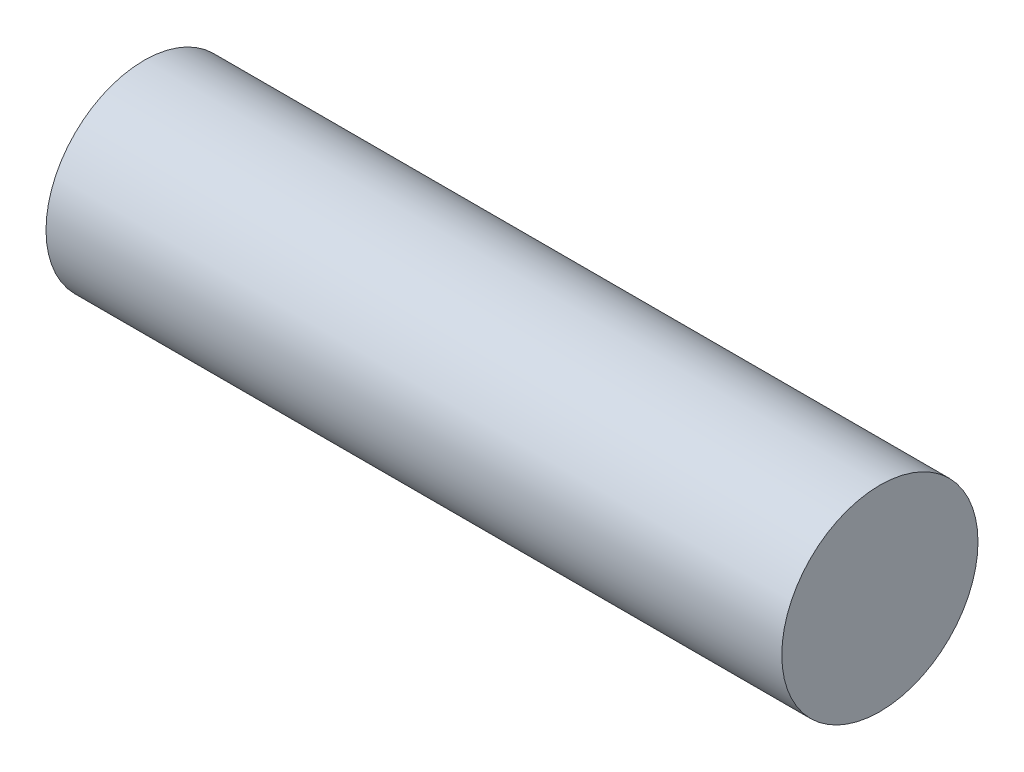
ISO-10303-21;
HEADER;
FILE_DESCRIPTION(('STEP AP214'),'2;1');
FILE_NAME('part.step','',(''),(''),'','','');
FILE_SCHEMA(('AUTOMOTIVE_DESIGN { 1 0 10303 214 1 1 1 1 }'));
ENDSEC;
DATA;
#1=APPLICATION_CONTEXT('core data for automotive mechanical design processes');
#2=APPLICATION_PROTOCOL_DEFINITION('international standard','automotive_design',2000,#1);
#3=PRODUCT_CONTEXT('',#1,'mechanical');
#4=PRODUCT('Part','Part','',(#3));
#5=PRODUCT_RELATED_PRODUCT_CATEGORY('part','',(#4));
#6=PRODUCT_DEFINITION_FORMATION('','',#4);
#7=PRODUCT_DEFINITION_CONTEXT('part definition',#1,'design');
#8=PRODUCT_DEFINITION('design','',#6,#7);
#9=PRODUCT_DEFINITION_SHAPE('','',#8);
#10=(LENGTH_UNIT() NAMED_UNIT(*) SI_UNIT(.MILLI.,.METRE.));
#11=(NAMED_UNIT(*) PLANE_ANGLE_UNIT() SI_UNIT($,.RADIAN.));
#12=(NAMED_UNIT(*) SI_UNIT($,.STERADIAN.) SOLID_ANGLE_UNIT());
#13=UNCERTAINTY_MEASURE_WITH_UNIT(LENGTH_MEASURE(1.E-05),#10,'distance_accuracy_value','');
#14=(GEOMETRIC_REPRESENTATION_CONTEXT(3) GLOBAL_UNCERTAINTY_ASSIGNED_CONTEXT((#13)) GLOBAL_UNIT_ASSIGNED_CONTEXT((#10,
#11,#12)) REPRESENTATION_CONTEXT('',''));
#15=CARTESIAN_POINT('',(0.,0.,0.));
#16=DIRECTION('',(0.,0.,1.));
#17=DIRECTION('',(1.,0.,0.));
#18=AXIS2_PLACEMENT_3D('',#15,#16,#17);
#19=CARTESIAN_POINT('',(300.,0.,0.));
#20=DIRECTION('',(-1.,0.,0.));
#21=DIRECTION('',(0.,0.,1.));
#22=AXIS2_PLACEMENT_3D('',#19,#20,#21);
#23=CYLINDRICAL_SURFACE('',#22,40.);
#24=CARTESIAN_POINT('',(300.,0.,0.));
#25=DIRECTION('',(1.,0.,0.));
#26=DIRECTION('',(0.,0.,-1.));
#27=AXIS2_PLACEMENT_3D('',#24,#25,#26);
#28=CIRCLE('',#27,40.);
#29=CARTESIAN_POINT('',(300.,0.,-40.));
#30=VERTEX_POINT('',#29);
#31=EDGE_CURVE('E10',#30,#30,#28,.T.);
#32=ORIENTED_EDGE('',*,*,#31,.F.);
#33=EDGE_LOOP('',(#32));
#34=FACE_BOUND('',#33,.T.);
#35=CARTESIAN_POINT('',(0.,0.,0.));
#36=DIRECTION('',(1.,0.,0.));
#37=DIRECTION('',(0.,0.,-1.));
#38=AXIS2_PLACEMENT_3D('',#35,#36,#37);
#39=CIRCLE('',#38,40.);
#40=CARTESIAN_POINT('',(0.,0.,-40.));
#41=VERTEX_POINT('',#40);
#42=EDGE_CURVE('E40',#41,#41,#39,.T.);
#43=ORIENTED_EDGE('',*,*,#42,.T.);
#44=EDGE_LOOP('',(#43));
#45=FACE_BOUND('',#44,.T.);
#46=ADVANCED_FACE('F37',(#34,#45),#23,.T.);
#47=CARTESIAN_POINT('',(300.,0.,0.));
#48=DIRECTION('',(1.,0.,0.));
#49=DIRECTION('',(0.,0.,-1.));
#50=AXIS2_PLACEMENT_3D('',#47,#48,#49);
#51=PLANE('',#50);
#52=ORIENTED_EDGE('',*,*,#31,.T.);
#53=EDGE_LOOP('',(#52));
#54=FACE_BOUND('',#53,.T.);
#55=ADVANCED_FACE('F52',(#54),#51,.T.);
#56=CARTESIAN_POINT('',(0.,0.,0.));
#57=DIRECTION('',(1.,0.,0.));
#58=DIRECTION('',(0.,0.,-1.));
#59=AXIS2_PLACEMENT_3D('',#56,#57,#58);
#60=PLANE('',#59);
#61=ORIENTED_EDGE('',*,*,#42,.F.);
#62=EDGE_LOOP('',(#61));
#63=FACE_BOUND('',#62,.T.);
#64=ADVANCED_FACE('F50',(#63),#60,.F.);
#65=CLOSED_SHELL('',(#46,#55,#64));
#66=MANIFOLD_SOLID_BREP('B2',#65);
#67=ADVANCED_BREP_SHAPE_REPRESENTATION('',(#18,#66),#14);
#68=SHAPE_DEFINITION_REPRESENTATION(#9,#67);
ENDSEC;
END-ISO-10303-21;
